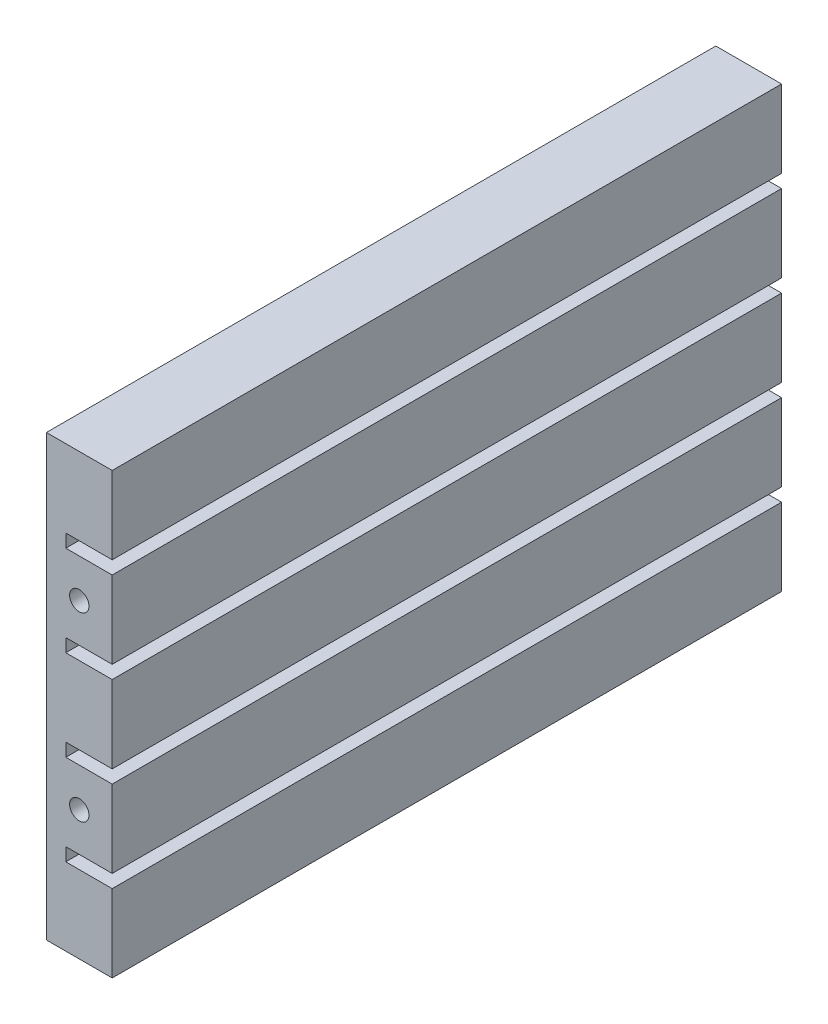
ISO-10303-21;
HEADER;
FILE_DESCRIPTION(('STEP AP214'),'2;1');
FILE_NAME('part.step','',(''),(''),'','','');
FILE_SCHEMA(('AUTOMOTIVE_DESIGN { 1 0 10303 214 1 1 1 1 }'));
ENDSEC;
DATA;
#1=APPLICATION_CONTEXT('core data for automotive mechanical design processes');
#2=APPLICATION_PROTOCOL_DEFINITION('international standard','automotive_design',2000,#1);
#3=PRODUCT_CONTEXT('',#1,'mechanical');
#4=PRODUCT('Part','Part','',(#3));
#5=PRODUCT_RELATED_PRODUCT_CATEGORY('part','',(#4));
#6=PRODUCT_DEFINITION_FORMATION('','',#4);
#7=PRODUCT_DEFINITION_CONTEXT('part definition',#1,'design');
#8=PRODUCT_DEFINITION('design','',#6,#7);
#9=PRODUCT_DEFINITION_SHAPE('','',#8);
#10=(LENGTH_UNIT() NAMED_UNIT(*) SI_UNIT(.MILLI.,.METRE.));
#11=(NAMED_UNIT(*) PLANE_ANGLE_UNIT() SI_UNIT($,.RADIAN.));
#12=(NAMED_UNIT(*) SI_UNIT($,.STERADIAN.) SOLID_ANGLE_UNIT());
#13=UNCERTAINTY_MEASURE_WITH_UNIT(LENGTH_MEASURE(1.E-05),#10,'distance_accuracy_value','');
#14=(GEOMETRIC_REPRESENTATION_CONTEXT(3) GLOBAL_UNCERTAINTY_ASSIGNED_CONTEXT((#13)) GLOBAL_UNIT_ASSIGNED_CONTEXT((#10,
#11,#12)) REPRESENTATION_CONTEXT('',''));
#15=CARTESIAN_POINT('',(0.,0.,0.));
#16=DIRECTION('',(0.,0.,1.));
#17=DIRECTION('',(1.,0.,0.));
#18=AXIS2_PLACEMENT_3D('',#15,#16,#17);
#19=CARTESIAN_POINT('',(8.50000000000001,0.,86.5));
#20=DIRECTION('',(0.,1.,0.));
#21=DIRECTION('',(0.,0.,1.));
#22=AXIS2_PLACEMENT_3D('',#19,#20,#21);
#23=PLANE('',#22);
#24=DIRECTION('',(1.,0.,0.));
#25=VECTOR('',#24,1.);
#26=CARTESIAN_POINT('',(8.50000000000001,0.,0.));
#27=LINE('',#26,#25);
#28=CARTESIAN_POINT('',(0.,0.,0.));
#29=VERTEX_POINT('',#28);
#30=CARTESIAN_POINT('',(8.50000000000001,0.,0.));
#31=VERTEX_POINT('',#30);
#32=EDGE_CURVE('E209',#29,#31,#27,.T.);
#33=ORIENTED_EDGE('',*,*,#32,.T.);
#34=DIRECTION('',(0.,0.,-1.));
#35=VECTOR('',#34,1.);
#36=CARTESIAN_POINT('',(8.50000000000001,0.,86.5));
#37=LINE('',#36,#35);
#38=CARTESIAN_POINT('',(8.50000000000001,0.,86.5));
#39=VERTEX_POINT('',#38);
#40=EDGE_CURVE('E11',#39,#31,#37,.T.);
#41=ORIENTED_EDGE('',*,*,#40,.F.);
#42=DIRECTION('',(1.,0.,0.));
#43=VECTOR('',#42,1.);
#44=CARTESIAN_POINT('',(8.50000000000001,0.,86.5));
#45=LINE('',#44,#43);
#46=CARTESIAN_POINT('',(0.,0.,86.5));
#47=VERTEX_POINT('',#46);
#48=EDGE_CURVE('E248',#47,#39,#45,.T.);
#49=ORIENTED_EDGE('',*,*,#48,.F.);
#50=DIRECTION('',(0.,0.,-1.));
#51=VECTOR('',#50,1.);
#52=CARTESIAN_POINT('',(0.,0.,86.5));
#53=LINE('',#52,#51);
#54=EDGE_CURVE('E205',#47,#29,#53,.T.);
#55=ORIENTED_EDGE('',*,*,#54,.T.);
#56=EDGE_LOOP('',(#33,#41,#49,#55));
#57=FACE_BOUND('',#56,.T.);
#58=ADVANCED_FACE('F38',(#57),#23,.F.);
#59=CARTESIAN_POINT('',(8.50000000000001,9.99999999999999,86.5));
#60=DIRECTION('',(-1.,0.,0.));
#61=DIRECTION('',(0.,0.,1.));
#62=AXIS2_PLACEMENT_3D('',#59,#60,#61);
#63=PLANE('',#62);
#64=DIRECTION('',(0.,1.,0.));
#65=VECTOR('',#64,1.);
#66=CARTESIAN_POINT('',(8.50000000000001,9.99999999999999,0.));
#67=LINE('',#66,#65);
#68=CARTESIAN_POINT('',(8.50000000000001,9.99999999999999,0.));
#69=VERTEX_POINT('',#68);
#70=EDGE_CURVE('E212',#31,#69,#67,.T.);
#71=ORIENTED_EDGE('',*,*,#70,.T.);
#72=DIRECTION('',(0.,0.,-1.));
#73=VECTOR('',#72,1.);
#74=CARTESIAN_POINT('',(8.50000000000001,9.99999999999999,86.5));
#75=LINE('',#74,#73);
#76=CARTESIAN_POINT('',(8.50000000000001,9.99999999999999,86.5));
#77=VERTEX_POINT('',#76);
#78=EDGE_CURVE('E46',#77,#69,#75,.T.);
#79=ORIENTED_EDGE('',*,*,#78,.F.);
#80=DIRECTION('',(0.,1.,0.));
#81=VECTOR('',#80,1.);
#82=CARTESIAN_POINT('',(8.50000000000001,9.99999999999999,86.5));
#83=LINE('',#82,#81);
#84=EDGE_CURVE('E134',#39,#77,#83,.T.);
#85=ORIENTED_EDGE('',*,*,#84,.F.);
#86=ORIENTED_EDGE('',*,*,#40,.T.);
#87=EDGE_LOOP('',(#71,#79,#85,#86));
#88=FACE_BOUND('',#87,.T.);
#89=ADVANCED_FACE('F370',(#88),#63,.F.);
#90=CARTESIAN_POINT('',(2.5,9.99999999999999,86.5));
#91=DIRECTION('',(0.,-1.,0.));
#92=DIRECTION('',(0.,0.,-1.));
#93=AXIS2_PLACEMENT_3D('',#90,#91,#92);
#94=PLANE('',#93);
#95=DIRECTION('',(-1.,0.,0.));
#96=VECTOR('',#95,1.);
#97=CARTESIAN_POINT('',(2.5,9.99999999999999,0.));
#98=LINE('',#97,#96);
#99=CARTESIAN_POINT('',(2.5,9.99999999999999,0.));
#100=VERTEX_POINT('',#99);
#101=EDGE_CURVE('E215',#69,#100,#98,.T.);
#102=ORIENTED_EDGE('',*,*,#101,.T.);
#103=DIRECTION('',(0.,0.,-1.));
#104=VECTOR('',#103,1.);
#105=CARTESIAN_POINT('',(2.5,9.99999999999999,86.5));
#106=LINE('',#105,#104);
#107=CARTESIAN_POINT('',(2.5,9.99999999999999,86.5));
#108=VERTEX_POINT('',#107);
#109=EDGE_CURVE('E291',#108,#100,#106,.T.);
#110=ORIENTED_EDGE('',*,*,#109,.F.);
#111=DIRECTION('',(-1.,0.,0.));
#112=VECTOR('',#111,1.);
#113=CARTESIAN_POINT('',(2.5,9.99999999999999,86.5));
#114=LINE('',#113,#112);
#115=EDGE_CURVE('E299',#77,#108,#114,.T.);
#116=ORIENTED_EDGE('',*,*,#115,.F.);
#117=ORIENTED_EDGE('',*,*,#78,.T.);
#118=EDGE_LOOP('',(#102,#110,#116,#117));
#119=FACE_BOUND('',#118,.T.);
#120=ADVANCED_FACE('F297',(#119),#94,.F.);
#121=CARTESIAN_POINT('',(2.5,11.7,86.5));
#122=DIRECTION('',(-1.,0.,0.));
#123=DIRECTION('',(0.,0.,1.));
#124=AXIS2_PLACEMENT_3D('',#121,#122,#123);
#125=PLANE('',#124);
#126=DIRECTION('',(0.,1.,0.));
#127=VECTOR('',#126,1.);
#128=CARTESIAN_POINT('',(2.5,11.7,0.));
#129=LINE('',#128,#127);
#130=CARTESIAN_POINT('',(2.5,11.7,0.));
#131=VERTEX_POINT('',#130);
#132=EDGE_CURVE('E217',#100,#131,#129,.T.);
#133=ORIENTED_EDGE('',*,*,#132,.T.);
#134=DIRECTION('',(0.,0.,-1.));
#135=VECTOR('',#134,1.);
#136=CARTESIAN_POINT('',(2.5,11.7,86.5));
#137=LINE('',#136,#135);
#138=CARTESIAN_POINT('',(2.5,11.7,86.5));
#139=VERTEX_POINT('',#138);
#140=EDGE_CURVE('E288',#139,#131,#137,.T.);
#141=ORIENTED_EDGE('',*,*,#140,.F.);
#142=DIRECTION('',(0.,1.,0.));
#143=VECTOR('',#142,1.);
#144=CARTESIAN_POINT('',(2.5,11.7,86.5));
#145=LINE('',#144,#143);
#146=EDGE_CURVE('E317',#108,#139,#145,.T.);
#147=ORIENTED_EDGE('',*,*,#146,.F.);
#148=ORIENTED_EDGE('',*,*,#109,.T.);
#149=EDGE_LOOP('',(#133,#141,#147,#148));
#150=FACE_BOUND('',#149,.T.);
#151=ADVANCED_FACE('F308',(#150),#125,.F.);
#152=CARTESIAN_POINT('',(8.50000000000001,11.7,86.5));
#153=DIRECTION('',(0.,1.,0.));
#154=DIRECTION('',(0.,0.,1.));
#155=AXIS2_PLACEMENT_3D('',#152,#153,#154);
#156=PLANE('',#155);
#157=DIRECTION('',(1.,0.,0.));
#158=VECTOR('',#157,1.);
#159=CARTESIAN_POINT('',(8.50000000000001,11.7,0.));
#160=LINE('',#159,#158);
#161=CARTESIAN_POINT('',(8.50000000000001,11.7,0.));
#162=VERTEX_POINT('',#161);
#163=EDGE_CURVE('E219',#131,#162,#160,.T.);
#164=ORIENTED_EDGE('',*,*,#163,.T.);
#165=DIRECTION('',(0.,0.,-1.));
#166=VECTOR('',#165,1.);
#167=CARTESIAN_POINT('',(8.50000000000001,11.7,86.5));
#168=LINE('',#167,#166);
#169=CARTESIAN_POINT('',(8.50000000000001,11.7,86.5));
#170=VERTEX_POINT('',#169);
#171=EDGE_CURVE('E285',#170,#162,#168,.T.);
#172=ORIENTED_EDGE('',*,*,#171,.F.);
#173=DIRECTION('',(1.,0.,0.));
#174=VECTOR('',#173,1.);
#175=CARTESIAN_POINT('',(8.50000000000001,11.7,86.5));
#176=LINE('',#175,#174);
#177=EDGE_CURVE('E314',#139,#170,#176,.T.);
#178=ORIENTED_EDGE('',*,*,#177,.F.);
#179=ORIENTED_EDGE('',*,*,#140,.T.);
#180=EDGE_LOOP('',(#164,#172,#178,#179));
#181=FACE_BOUND('',#180,.T.);
#182=ADVANCED_FACE('F312',(#181),#156,.F.);
#183=CARTESIAN_POINT('',(8.50000000000001,21.7,86.5));
#184=DIRECTION('',(-1.,0.,0.));
#185=DIRECTION('',(0.,-1.,0.));
#186=AXIS2_PLACEMENT_3D('',#183,#184,#185);
#187=PLANE('',#186);
#188=DIRECTION('',(0.,1.,0.));
#189=VECTOR('',#188,1.);
#190=CARTESIAN_POINT('',(8.50000000000001,21.7,0.));
#191=LINE('',#190,#189);
#192=CARTESIAN_POINT('',(8.50000000000001,21.7,0.));
#193=VERTEX_POINT('',#192);
#194=EDGE_CURVE('E221',#162,#193,#191,.T.);
#195=ORIENTED_EDGE('',*,*,#194,.T.);
#196=DIRECTION('',(0.,0.,-1.));
#197=VECTOR('',#196,1.);
#198=CARTESIAN_POINT('',(8.50000000000001,21.7,86.5));
#199=LINE('',#198,#197);
#200=CARTESIAN_POINT('',(8.50000000000001,21.7,86.5));
#201=VERTEX_POINT('',#200);
#202=EDGE_CURVE('E282',#201,#193,#199,.T.);
#203=ORIENTED_EDGE('',*,*,#202,.F.);
#204=DIRECTION('',(0.,1.,0.));
#205=VECTOR('',#204,1.);
#206=CARTESIAN_POINT('',(8.50000000000001,21.7,86.5));
#207=LINE('',#206,#205);
#208=EDGE_CURVE('E316',#170,#201,#207,.T.);
#209=ORIENTED_EDGE('',*,*,#208,.F.);
#210=ORIENTED_EDGE('',*,*,#171,.T.);
#211=EDGE_LOOP('',(#195,#203,#209,#210));
#212=FACE_BOUND('',#211,.T.);
#213=ADVANCED_FACE('F383',(#212),#187,.F.);
#214=CARTESIAN_POINT('',(2.5,21.7,86.5));
#215=DIRECTION('',(0.,-1.,0.));
#216=DIRECTION('',(0.,0.,-1.));
#217=AXIS2_PLACEMENT_3D('',#214,#215,#216);
#218=PLANE('',#217);
#219=DIRECTION('',(-1.,0.,0.));
#220=VECTOR('',#219,1.);
#221=CARTESIAN_POINT('',(2.5,21.7,0.));
#222=LINE('',#221,#220);
#223=CARTESIAN_POINT('',(2.5,21.7,0.));
#224=VERTEX_POINT('',#223);
#225=EDGE_CURVE('E223',#193,#224,#222,.T.);
#226=ORIENTED_EDGE('',*,*,#225,.T.);
#227=DIRECTION('',(0.,0.,-1.));
#228=VECTOR('',#227,1.);
#229=CARTESIAN_POINT('',(2.5,21.7,86.5));
#230=LINE('',#229,#228);
#231=CARTESIAN_POINT('',(2.5,21.7,86.5));
#232=VERTEX_POINT('',#231);
#233=EDGE_CURVE('E279',#232,#224,#230,.T.);
#234=ORIENTED_EDGE('',*,*,#233,.F.);
#235=DIRECTION('',(-1.,0.,0.));
#236=VECTOR('',#235,1.);
#237=CARTESIAN_POINT('',(2.5,21.7,86.5));
#238=LINE('',#237,#236);
#239=EDGE_CURVE('E319',#201,#232,#238,.T.);
#240=ORIENTED_EDGE('',*,*,#239,.F.);
#241=ORIENTED_EDGE('',*,*,#202,.T.);
#242=EDGE_LOOP('',(#226,#234,#240,#241));
#243=FACE_BOUND('',#242,.T.);
#244=ADVANCED_FACE('F386',(#243),#218,.F.);
#245=CARTESIAN_POINT('',(2.5,23.4,86.5));
#246=DIRECTION('',(-1.,0.,0.));
#247=DIRECTION('',(0.,0.,1.));
#248=AXIS2_PLACEMENT_3D('',#245,#246,#247);
#249=PLANE('',#248);
#250=DIRECTION('',(0.,1.,0.));
#251=VECTOR('',#250,1.);
#252=CARTESIAN_POINT('',(2.5,23.4,0.));
#253=LINE('',#252,#251);
#254=CARTESIAN_POINT('',(2.5,23.4,0.));
#255=VERTEX_POINT('',#254);
#256=EDGE_CURVE('E225',#224,#255,#253,.T.);
#257=ORIENTED_EDGE('',*,*,#256,.T.);
#258=DIRECTION('',(0.,0.,-1.));
#259=VECTOR('',#258,1.);
#260=CARTESIAN_POINT('',(2.5,23.4,86.5));
#261=LINE('',#260,#259);
#262=CARTESIAN_POINT('',(2.5,23.4,86.5));
#263=VERTEX_POINT('',#262);
#264=EDGE_CURVE('E276',#263,#255,#261,.T.);
#265=ORIENTED_EDGE('',*,*,#264,.F.);
#266=DIRECTION('',(0.,1.,0.));
#267=VECTOR('',#266,1.);
#268=CARTESIAN_POINT('',(2.5,23.4,86.5));
#269=LINE('',#268,#267);
#270=EDGE_CURVE('E325',#232,#263,#269,.T.);
#271=ORIENTED_EDGE('',*,*,#270,.F.);
#272=ORIENTED_EDGE('',*,*,#233,.T.);
#273=EDGE_LOOP('',(#257,#265,#271,#272));
#274=FACE_BOUND('',#273,.T.);
#275=ADVANCED_FACE('F390',(#274),#249,.F.);
#276=CARTESIAN_POINT('',(8.50000000000001,23.4,86.5));
#277=DIRECTION('',(0.,1.,0.));
#278=DIRECTION('',(0.,0.,1.));
#279=AXIS2_PLACEMENT_3D('',#276,#277,#278);
#280=PLANE('',#279);
#281=DIRECTION('',(1.,0.,0.));
#282=VECTOR('',#281,1.);
#283=CARTESIAN_POINT('',(8.50000000000001,23.4,0.));
#284=LINE('',#283,#282);
#285=CARTESIAN_POINT('',(8.50000000000001,23.4,0.));
#286=VERTEX_POINT('',#285);
#287=EDGE_CURVE('E227',#255,#286,#284,.T.);
#288=ORIENTED_EDGE('',*,*,#287,.T.);
#289=DIRECTION('',(0.,0.,-1.));
#290=VECTOR('',#289,1.);
#291=CARTESIAN_POINT('',(8.50000000000001,23.4,86.5));
#292=LINE('',#291,#290);
#293=CARTESIAN_POINT('',(8.50000000000001,23.4,86.5));
#294=VERTEX_POINT('',#293);
#295=EDGE_CURVE('E273',#294,#286,#292,.T.);
#296=ORIENTED_EDGE('',*,*,#295,.F.);
#297=DIRECTION('',(1.,0.,0.));
#298=VECTOR('',#297,1.);
#299=CARTESIAN_POINT('',(8.50000000000001,23.4,86.5));
#300=LINE('',#299,#298);
#301=EDGE_CURVE('E327',#263,#294,#300,.T.);
#302=ORIENTED_EDGE('',*,*,#301,.F.);
#303=ORIENTED_EDGE('',*,*,#264,.T.);
#304=EDGE_LOOP('',(#288,#296,#302,#303));
#305=FACE_BOUND('',#304,.T.);
#306=ADVANCED_FACE('F394',(#305),#280,.F.);
#307=CARTESIAN_POINT('',(8.5,33.4,86.5));
#308=DIRECTION('',(-1.,0.,0.));
#309=DIRECTION('',(0.,-1.,0.));
#310=AXIS2_PLACEMENT_3D('',#307,#308,#309);
#311=PLANE('',#310);
#312=DIRECTION('',(0.,1.,0.));
#313=VECTOR('',#312,1.);
#314=CARTESIAN_POINT('',(8.5,33.4,0.));
#315=LINE('',#314,#313);
#316=CARTESIAN_POINT('',(8.5,33.4,0.));
#317=VERTEX_POINT('',#316);
#318=EDGE_CURVE('E229',#286,#317,#315,.T.);
#319=ORIENTED_EDGE('',*,*,#318,.T.);
#320=DIRECTION('',(0.,0.,-1.));
#321=VECTOR('',#320,1.);
#322=CARTESIAN_POINT('',(8.5,33.4,86.5));
#323=LINE('',#322,#321);
#324=CARTESIAN_POINT('',(8.5,33.4,86.5));
#325=VERTEX_POINT('',#324);
#326=EDGE_CURVE('E270',#325,#317,#323,.T.);
#327=ORIENTED_EDGE('',*,*,#326,.F.);
#328=DIRECTION('',(0.,1.,0.));
#329=VECTOR('',#328,1.);
#330=CARTESIAN_POINT('',(8.5,33.4,86.5));
#331=LINE('',#330,#329);
#332=EDGE_CURVE('E329',#294,#325,#331,.T.);
#333=ORIENTED_EDGE('',*,*,#332,.F.);
#334=ORIENTED_EDGE('',*,*,#295,.T.);
#335=EDGE_LOOP('',(#319,#327,#333,#334));
#336=FACE_BOUND('',#335,.T.);
#337=ADVANCED_FACE('F398',(#336),#311,.F.);
#338=CARTESIAN_POINT('',(2.5,33.4,86.5));
#339=DIRECTION('',(0.,-1.,0.));
#340=DIRECTION('',(0.,0.,-1.));
#341=AXIS2_PLACEMENT_3D('',#338,#339,#340);
#342=PLANE('',#341);
#343=DIRECTION('',(-1.,0.,0.));
#344=VECTOR('',#343,1.);
#345=CARTESIAN_POINT('',(2.5,33.4,0.));
#346=LINE('',#345,#344);
#347=CARTESIAN_POINT('',(2.5,33.4,0.));
#348=VERTEX_POINT('',#347);
#349=EDGE_CURVE('E231',#317,#348,#346,.T.);
#350=ORIENTED_EDGE('',*,*,#349,.T.);
#351=DIRECTION('',(0.,0.,-1.));
#352=VECTOR('',#351,1.);
#353=CARTESIAN_POINT('',(2.5,33.4,86.5));
#354=LINE('',#353,#352);
#355=CARTESIAN_POINT('',(2.5,33.4,86.5));
#356=VERTEX_POINT('',#355);
#357=EDGE_CURVE('E267',#356,#348,#354,.T.);
#358=ORIENTED_EDGE('',*,*,#357,.F.);
#359=DIRECTION('',(-1.,0.,0.));
#360=VECTOR('',#359,1.);
#361=CARTESIAN_POINT('',(2.5,33.4,86.5));
#362=LINE('',#361,#360);
#363=EDGE_CURVE('E331',#325,#356,#362,.T.);
#364=ORIENTED_EDGE('',*,*,#363,.F.);
#365=ORIENTED_EDGE('',*,*,#326,.T.);
#366=EDGE_LOOP('',(#350,#358,#364,#365));
#367=FACE_BOUND('',#366,.T.);
#368=ADVANCED_FACE('F402',(#367),#342,.F.);
#369=CARTESIAN_POINT('',(2.5,35.1,86.5));
#370=DIRECTION('',(-1.,0.,0.));
#371=DIRECTION('',(0.,0.,1.));
#372=AXIS2_PLACEMENT_3D('',#369,#370,#371);
#373=PLANE('',#372);
#374=DIRECTION('',(0.,1.,0.));
#375=VECTOR('',#374,1.);
#376=CARTESIAN_POINT('',(2.5,35.1,0.));
#377=LINE('',#376,#375);
#378=CARTESIAN_POINT('',(2.5,35.1,0.));
#379=VERTEX_POINT('',#378);
#380=EDGE_CURVE('E233',#348,#379,#377,.T.);
#381=ORIENTED_EDGE('',*,*,#380,.T.);
#382=DIRECTION('',(0.,0.,-1.));
#383=VECTOR('',#382,1.);
#384=CARTESIAN_POINT('',(2.5,35.1,86.5));
#385=LINE('',#384,#383);
#386=CARTESIAN_POINT('',(2.5,35.1,86.5));
#387=VERTEX_POINT('',#386);
#388=EDGE_CURVE('E264',#387,#379,#385,.T.);
#389=ORIENTED_EDGE('',*,*,#388,.F.);
#390=DIRECTION('',(0.,1.,0.));
#391=VECTOR('',#390,1.);
#392=CARTESIAN_POINT('',(2.5,35.1,86.5));
#393=LINE('',#392,#391);
#394=EDGE_CURVE('E333',#356,#387,#393,.T.);
#395=ORIENTED_EDGE('',*,*,#394,.F.);
#396=ORIENTED_EDGE('',*,*,#357,.T.);
#397=EDGE_LOOP('',(#381,#389,#395,#396));
#398=FACE_BOUND('',#397,.T.);
#399=ADVANCED_FACE('F406',(#398),#373,.F.);
#400=CARTESIAN_POINT('',(8.5,35.1,86.5));
#401=DIRECTION('',(0.,1.,0.));
#402=DIRECTION('',(0.,0.,1.));
#403=AXIS2_PLACEMENT_3D('',#400,#401,#402);
#404=PLANE('',#403);
#405=DIRECTION('',(1.,0.,0.));
#406=VECTOR('',#405,1.);
#407=CARTESIAN_POINT('',(8.5,35.1,0.));
#408=LINE('',#407,#406);
#409=CARTESIAN_POINT('',(8.5,35.1,0.));
#410=VERTEX_POINT('',#409);
#411=EDGE_CURVE('E235',#379,#410,#408,.T.);
#412=ORIENTED_EDGE('',*,*,#411,.T.);
#413=DIRECTION('',(0.,0.,-1.));
#414=VECTOR('',#413,1.);
#415=CARTESIAN_POINT('',(8.5,35.1,86.5));
#416=LINE('',#415,#414);
#417=CARTESIAN_POINT('',(8.5,35.1,86.5));
#418=VERTEX_POINT('',#417);
#419=EDGE_CURVE('E261',#418,#410,#416,.T.);
#420=ORIENTED_EDGE('',*,*,#419,.F.);
#421=DIRECTION('',(1.,0.,0.));
#422=VECTOR('',#421,1.);
#423=CARTESIAN_POINT('',(8.5,35.1,86.5));
#424=LINE('',#423,#422);
#425=EDGE_CURVE('E335',#387,#418,#424,.T.);
#426=ORIENTED_EDGE('',*,*,#425,.F.);
#427=ORIENTED_EDGE('',*,*,#388,.T.);
#428=EDGE_LOOP('',(#412,#420,#426,#427));
#429=FACE_BOUND('',#428,.T.);
#430=ADVANCED_FACE('F410',(#429),#404,.F.);
#431=CARTESIAN_POINT('',(8.5,45.1,86.5));
#432=DIRECTION('',(-1.,0.,0.));
#433=DIRECTION('',(0.,-1.,0.));
#434=AXIS2_PLACEMENT_3D('',#431,#432,#433);
#435=PLANE('',#434);
#436=DIRECTION('',(0.,1.,0.));
#437=VECTOR('',#436,1.);
#438=CARTESIAN_POINT('',(8.5,45.1,0.));
#439=LINE('',#438,#437);
#440=CARTESIAN_POINT('',(8.5,45.1,0.));
#441=VERTEX_POINT('',#440);
#442=EDGE_CURVE('E237',#410,#441,#439,.T.);
#443=ORIENTED_EDGE('',*,*,#442,.T.);
#444=DIRECTION('',(0.,0.,-1.));
#445=VECTOR('',#444,1.);
#446=CARTESIAN_POINT('',(8.5,45.1,86.5));
#447=LINE('',#446,#445);
#448=CARTESIAN_POINT('',(8.5,45.1,86.5));
#449=VERTEX_POINT('',#448);
#450=EDGE_CURVE('E258',#449,#441,#447,.T.);
#451=ORIENTED_EDGE('',*,*,#450,.F.);
#452=DIRECTION('',(0.,1.,0.));
#453=VECTOR('',#452,1.);
#454=CARTESIAN_POINT('',(8.5,45.1,86.5));
#455=LINE('',#454,#453);
#456=EDGE_CURVE('E337',#418,#449,#455,.T.);
#457=ORIENTED_EDGE('',*,*,#456,.F.);
#458=ORIENTED_EDGE('',*,*,#419,.T.);
#459=EDGE_LOOP('',(#443,#451,#457,#458));
#460=FACE_BOUND('',#459,.T.);
#461=ADVANCED_FACE('F414',(#460),#435,.F.);
#462=CARTESIAN_POINT('',(2.5,45.1,86.5));
#463=DIRECTION('',(0.,-1.,0.));
#464=DIRECTION('',(0.,0.,-1.));
#465=AXIS2_PLACEMENT_3D('',#462,#463,#464);
#466=PLANE('',#465);
#467=DIRECTION('',(-1.,0.,0.));
#468=VECTOR('',#467,1.);
#469=CARTESIAN_POINT('',(2.5,45.1,0.));
#470=LINE('',#469,#468);
#471=CARTESIAN_POINT('',(2.5,45.1,0.));
#472=VERTEX_POINT('',#471);
#473=EDGE_CURVE('E239',#441,#472,#470,.T.);
#474=ORIENTED_EDGE('',*,*,#473,.T.);
#475=DIRECTION('',(0.,0.,-1.));
#476=VECTOR('',#475,1.);
#477=CARTESIAN_POINT('',(2.5,45.1,86.5));
#478=LINE('',#477,#476);
#479=CARTESIAN_POINT('',(2.5,45.1,86.5));
#480=VERTEX_POINT('',#479);
#481=EDGE_CURVE('E255',#480,#472,#478,.T.);
#482=ORIENTED_EDGE('',*,*,#481,.F.);
#483=DIRECTION('',(-1.,0.,0.));
#484=VECTOR('',#483,1.);
#485=CARTESIAN_POINT('',(2.5,45.1,86.5));
#486=LINE('',#485,#484);
#487=EDGE_CURVE('E339',#449,#480,#486,.T.);
#488=ORIENTED_EDGE('',*,*,#487,.F.);
#489=ORIENTED_EDGE('',*,*,#450,.T.);
#490=EDGE_LOOP('',(#474,#482,#488,#489));
#491=FACE_BOUND('',#490,.T.);
#492=ADVANCED_FACE('F418',(#491),#466,.F.);
#493=CARTESIAN_POINT('',(2.5,46.8,86.5));
#494=DIRECTION('',(-1.,0.,0.));
#495=DIRECTION('',(0.,0.,1.));
#496=AXIS2_PLACEMENT_3D('',#493,#494,#495);
#497=PLANE('',#496);
#498=DIRECTION('',(0.,1.,0.));
#499=VECTOR('',#498,1.);
#500=CARTESIAN_POINT('',(2.5,46.8,0.));
#501=LINE('',#500,#499);
#502=CARTESIAN_POINT('',(2.5,46.8,0.));
#503=VERTEX_POINT('',#502);
#504=EDGE_CURVE('E241',#472,#503,#501,.T.);
#505=ORIENTED_EDGE('',*,*,#504,.T.);
#506=DIRECTION('',(0.,0.,-1.));
#507=VECTOR('',#506,1.);
#508=CARTESIAN_POINT('',(2.5,46.8,86.5));
#509=LINE('',#508,#507);
#510=CARTESIAN_POINT('',(2.5,46.8,86.5));
#511=VERTEX_POINT('',#510);
#512=EDGE_CURVE('E252',#511,#503,#509,.T.);
#513=ORIENTED_EDGE('',*,*,#512,.F.);
#514=DIRECTION('',(0.,1.,0.));
#515=VECTOR('',#514,1.);
#516=CARTESIAN_POINT('',(2.5,46.8,86.5));
#517=LINE('',#516,#515);
#518=EDGE_CURVE('E341',#480,#511,#517,.T.);
#519=ORIENTED_EDGE('',*,*,#518,.F.);
#520=ORIENTED_EDGE('',*,*,#481,.T.);
#521=EDGE_LOOP('',(#505,#513,#519,#520));
#522=FACE_BOUND('',#521,.T.);
#523=ADVANCED_FACE('F347',(#522),#497,.F.);
#524=CARTESIAN_POINT('',(8.5,46.8,86.5));
#525=DIRECTION('',(0.,1.,0.));
#526=DIRECTION('',(0.,0.,1.));
#527=AXIS2_PLACEMENT_3D('',#524,#525,#526);
#528=PLANE('',#527);
#529=DIRECTION('',(1.,0.,0.));
#530=VECTOR('',#529,1.);
#531=CARTESIAN_POINT('',(8.5,46.8,0.));
#532=LINE('',#531,#530);
#533=CARTESIAN_POINT('',(8.5,46.8,0.));
#534=VERTEX_POINT('',#533);
#535=EDGE_CURVE('E243',#503,#534,#532,.T.);
#536=ORIENTED_EDGE('',*,*,#535,.T.);
#537=DIRECTION('',(0.,0.,-1.));
#538=VECTOR('',#537,1.);
#539=CARTESIAN_POINT('',(8.5,46.8,86.5));
#540=LINE('',#539,#538);
#541=CARTESIAN_POINT('',(8.5,46.8,86.5));
#542=VERTEX_POINT('',#541);
#543=EDGE_CURVE('E200',#542,#534,#540,.T.);
#544=ORIENTED_EDGE('',*,*,#543,.F.);
#545=DIRECTION('',(1.,0.,0.));
#546=VECTOR('',#545,1.);
#547=CARTESIAN_POINT('',(8.5,46.8,86.5));
#548=LINE('',#547,#546);
#549=EDGE_CURVE('E191',#511,#542,#548,.T.);
#550=ORIENTED_EDGE('',*,*,#549,.F.);
#551=ORIENTED_EDGE('',*,*,#512,.T.);
#552=EDGE_LOOP('',(#536,#544,#550,#551));
#553=FACE_BOUND('',#552,.T.);
#554=ADVANCED_FACE('F351',(#553),#528,.F.);
#555=CARTESIAN_POINT('',(8.5,56.8,86.5));
#556=DIRECTION('',(-1.,0.,0.));
#557=DIRECTION('',(0.,-1.,0.));
#558=AXIS2_PLACEMENT_3D('',#555,#556,#557);
#559=PLANE('',#558);
#560=DIRECTION('',(0.,1.,0.));
#561=VECTOR('',#560,1.);
#562=CARTESIAN_POINT('',(8.5,56.8,0.));
#563=LINE('',#562,#561);
#564=CARTESIAN_POINT('',(8.5,56.8,0.));
#565=VERTEX_POINT('',#564);
#566=EDGE_CURVE('E199',#534,#565,#563,.T.);
#567=ORIENTED_EDGE('',*,*,#566,.T.);
#568=DIRECTION('',(0.,0.,-1.));
#569=VECTOR('',#568,1.);
#570=CARTESIAN_POINT('',(8.5,56.8,86.5));
#571=LINE('',#570,#569);
#572=CARTESIAN_POINT('',(8.5,56.8,86.5));
#573=VERTEX_POINT('',#572);
#574=EDGE_CURVE('E196',#573,#565,#571,.T.);
#575=ORIENTED_EDGE('',*,*,#574,.F.);
#576=DIRECTION('',(0.,1.,0.));
#577=VECTOR('',#576,1.);
#578=CARTESIAN_POINT('',(8.5,56.8,86.5));
#579=LINE('',#578,#577);
#580=EDGE_CURVE('E185',#542,#573,#579,.T.);
#581=ORIENTED_EDGE('',*,*,#580,.F.);
#582=ORIENTED_EDGE('',*,*,#543,.T.);
#583=EDGE_LOOP('',(#567,#575,#581,#582));
#584=FACE_BOUND('',#583,.T.);
#585=ADVANCED_FACE('F197',(#584),#559,.F.);
#586=CARTESIAN_POINT('',(0.,56.8,86.5));
#587=DIRECTION('',(0.,-1.,0.));
#588=DIRECTION('',(0.,0.,-1.));
#589=AXIS2_PLACEMENT_3D('',#586,#587,#588);
#590=PLANE('',#589);
#591=DIRECTION('',(-1.,0.,0.));
#592=VECTOR('',#591,1.);
#593=CARTESIAN_POINT('',(0.,56.8,0.));
#594=LINE('',#593,#592);
#595=CARTESIAN_POINT('',(0.,56.8,0.));
#596=VERTEX_POINT('',#595);
#597=EDGE_CURVE('E120',#565,#596,#594,.T.);
#598=ORIENTED_EDGE('',*,*,#597,.T.);
#599=DIRECTION('',(0.,0.,-1.));
#600=VECTOR('',#599,1.);
#601=CARTESIAN_POINT('',(0.,56.8,86.5));
#602=LINE('',#601,#600);
#603=CARTESIAN_POINT('',(0.,56.8,86.5));
#604=VERTEX_POINT('',#603);
#605=EDGE_CURVE('E201',#604,#596,#602,.T.);
#606=ORIENTED_EDGE('',*,*,#605,.F.);
#607=DIRECTION('',(-1.,0.,0.));
#608=VECTOR('',#607,1.);
#609=CARTESIAN_POINT('',(0.,56.8,86.5));
#610=LINE('',#609,#608);
#611=EDGE_CURVE('E189',#573,#604,#610,.T.);
#612=ORIENTED_EDGE('',*,*,#611,.F.);
#613=ORIENTED_EDGE('',*,*,#574,.T.);
#614=EDGE_LOOP('',(#598,#606,#612,#613));
#615=FACE_BOUND('',#614,.T.);
#616=ADVANCED_FACE('F203',(#615),#590,.F.);
#617=CARTESIAN_POINT('',(0.,0.,86.5));
#618=DIRECTION('',(1.,0.,0.));
#619=DIRECTION('',(0.,0.,-1.));
#620=AXIS2_PLACEMENT_3D('',#617,#618,#619);
#621=PLANE('',#620);
#622=CARTESIAN_POINT('',(0.,51.8,78.25));
#623=DIRECTION('',(-1.,0.,0.));
#624=DIRECTION('',(0.,0.,1.));
#625=AXIS2_PLACEMENT_3D('',#622,#623,#624);
#626=CIRCLE('',#625,1.25);
#627=CARTESIAN_POINT('',(0.,51.8,79.5));
#628=VERTEX_POINT('',#627);
#629=EDGE_CURVE('E623',#628,#628,#626,.T.);
#630=ORIENTED_EDGE('',*,*,#629,.F.);
#631=EDGE_LOOP('',(#630));
#632=FACE_BOUND('',#631,.T.);
#633=CARTESIAN_POINT('',(0.,5.,78.25));
#634=DIRECTION('',(-1.,0.,0.));
#635=DIRECTION('',(0.,0.,1.));
#636=AXIS2_PLACEMENT_3D('',#633,#634,#635);
#637=CIRCLE('',#636,1.25);
#638=CARTESIAN_POINT('',(0.,5.,79.5));
#639=VERTEX_POINT('',#638);
#640=EDGE_CURVE('E625',#639,#639,#637,.T.);
#641=ORIENTED_EDGE('',*,*,#640,.F.);
#642=EDGE_LOOP('',(#641));
#643=FACE_BOUND('',#642,.T.);
#644=CARTESIAN_POINT('',(0.,51.8,8.24999999999999));
#645=DIRECTION('',(-1.,0.,0.));
#646=DIRECTION('',(0.,0.,1.));
#647=AXIS2_PLACEMENT_3D('',#644,#645,#646);
#648=CIRCLE('',#647,1.25);
#649=CARTESIAN_POINT('',(0.,51.8,9.49999999999999));
#650=VERTEX_POINT('',#649);
#651=EDGE_CURVE('E633',#650,#650,#648,.T.);
#652=ORIENTED_EDGE('',*,*,#651,.F.);
#653=EDGE_LOOP('',(#652));
#654=FACE_BOUND('',#653,.T.);
#655=CARTESIAN_POINT('',(0.,5.,8.24999999999999));
#656=DIRECTION('',(-1.,0.,0.));
#657=DIRECTION('',(0.,0.,1.));
#658=AXIS2_PLACEMENT_3D('',#655,#656,#657);
#659=CIRCLE('',#658,1.25);
#660=CARTESIAN_POINT('',(0.,5.,9.49999999999999));
#661=VERTEX_POINT('',#660);
#662=EDGE_CURVE('E639',#661,#661,#659,.T.);
#663=ORIENTED_EDGE('',*,*,#662,.F.);
#664=EDGE_LOOP('',(#663));
#665=FACE_BOUND('',#664,.T.);
#666=DIRECTION('',(0.,-1.,0.));
#667=VECTOR('',#666,1.);
#668=CARTESIAN_POINT('',(0.,0.,0.));
#669=LINE('',#668,#667);
#670=EDGE_CURVE('E126',#596,#29,#669,.T.);
#671=ORIENTED_EDGE('',*,*,#670,.T.);
#672=ORIENTED_EDGE('',*,*,#54,.F.);
#673=DIRECTION('',(0.,-1.,0.));
#674=VECTOR('',#673,1.);
#675=CARTESIAN_POINT('',(0.,0.,86.5));
#676=LINE('',#675,#674);
#677=EDGE_CURVE('E54',#604,#47,#676,.T.);
#678=ORIENTED_EDGE('',*,*,#677,.F.);
#679=ORIENTED_EDGE('',*,*,#605,.T.);
#680=EDGE_LOOP('',(#671,#672,#678,#679));
#681=FACE_BOUND('',#680,.T.);
#682=ADVANCED_FACE('F355',(#632,#643,#654,#665,#681),#621,.F.);
#683=CARTESIAN_POINT('',(0.,0.,86.5));
#684=DIRECTION('',(0.,0.,-1.));
#685=DIRECTION('',(-1.,0.,0.));
#686=AXIS2_PLACEMENT_3D('',#683,#684,#685);
#687=PLANE('',#686);
#688=CARTESIAN_POINT('',(4.25,40.1,86.5));
#689=DIRECTION('',(0.,0.,1.));
#690=DIRECTION('',(1.,0.,0.));
#691=AXIS2_PLACEMENT_3D('',#688,#689,#690);
#692=CIRCLE('',#691,1.25);
#693=CARTESIAN_POINT('',(5.5,40.1,86.5));
#694=VERTEX_POINT('',#693);
#695=EDGE_CURVE('E657',#694,#694,#692,.T.);
#696=ORIENTED_EDGE('',*,*,#695,.F.);
#697=EDGE_LOOP('',(#696));
#698=FACE_BOUND('',#697,.T.);
#699=CARTESIAN_POINT('',(4.25,16.7,86.5));
#700=DIRECTION('',(0.,0.,1.));
#701=DIRECTION('',(1.,0.,0.));
#702=AXIS2_PLACEMENT_3D('',#699,#700,#701);
#703=CIRCLE('',#702,1.25);
#704=CARTESIAN_POINT('',(5.5,16.7,86.5));
#705=VERTEX_POINT('',#704);
#706=EDGE_CURVE('E663',#705,#705,#703,.T.);
#707=ORIENTED_EDGE('',*,*,#706,.F.);
#708=EDGE_LOOP('',(#707));
#709=FACE_BOUND('',#708,.T.);
#710=ORIENTED_EDGE('',*,*,#48,.T.);
#711=ORIENTED_EDGE('',*,*,#84,.T.);
#712=ORIENTED_EDGE('',*,*,#115,.T.);
#713=ORIENTED_EDGE('',*,*,#146,.T.);
#714=ORIENTED_EDGE('',*,*,#177,.T.);
#715=ORIENTED_EDGE('',*,*,#208,.T.);
#716=ORIENTED_EDGE('',*,*,#239,.T.);
#717=ORIENTED_EDGE('',*,*,#270,.T.);
#718=ORIENTED_EDGE('',*,*,#301,.T.);
#719=ORIENTED_EDGE('',*,*,#332,.T.);
#720=ORIENTED_EDGE('',*,*,#363,.T.);
#721=ORIENTED_EDGE('',*,*,#394,.T.);
#722=ORIENTED_EDGE('',*,*,#425,.T.);
#723=ORIENTED_EDGE('',*,*,#456,.T.);
#724=ORIENTED_EDGE('',*,*,#487,.T.);
#725=ORIENTED_EDGE('',*,*,#518,.T.);
#726=ORIENTED_EDGE('',*,*,#549,.T.);
#727=ORIENTED_EDGE('',*,*,#580,.T.);
#728=ORIENTED_EDGE('',*,*,#611,.T.);
#729=ORIENTED_EDGE('',*,*,#677,.T.);
#730=EDGE_LOOP('',(#710,#711,#712,#713,#714,#715,#716,#717,#718,#719,#720,#721,#722,#723,#724,
#725,#726,#727,#728,#729));
#731=FACE_BOUND('',#730,.T.);
#732=ADVANCED_FACE('F187',(#698,#709,#731),#687,.F.);
#733=CARTESIAN_POINT('',(0.,0.,0.));
#734=DIRECTION('',(0.,0.,-1.));
#735=DIRECTION('',(-1.,0.,0.));
#736=AXIS2_PLACEMENT_3D('',#733,#734,#735);
#737=PLANE('',#736);
#738=CARTESIAN_POINT('',(4.25,40.1,0.));
#739=DIRECTION('',(0.,0.,-1.));
#740=DIRECTION('',(-1.,0.,0.));
#741=AXIS2_PLACEMENT_3D('',#738,#739,#740);
#742=CIRCLE('',#741,1.25);
#743=CARTESIAN_POINT('',(3.,40.1,0.));
#744=VERTEX_POINT('',#743);
#745=EDGE_CURVE('E645',#744,#744,#742,.T.);
#746=ORIENTED_EDGE('',*,*,#745,.F.);
#747=EDGE_LOOP('',(#746));
#748=FACE_BOUND('',#747,.T.);
#749=CARTESIAN_POINT('',(4.25,16.7,0.));
#750=DIRECTION('',(0.,0.,-1.));
#751=DIRECTION('',(-1.,0.,0.));
#752=AXIS2_PLACEMENT_3D('',#749,#750,#751);
#753=CIRCLE('',#752,1.25);
#754=CARTESIAN_POINT('',(3.,16.7,0.));
#755=VERTEX_POINT('',#754);
#756=EDGE_CURVE('E651',#755,#755,#753,.T.);
#757=ORIENTED_EDGE('',*,*,#756,.F.);
#758=EDGE_LOOP('',(#757));
#759=FACE_BOUND('',#758,.T.);
#760=ORIENTED_EDGE('',*,*,#32,.F.);
#761=ORIENTED_EDGE('',*,*,#670,.F.);
#762=ORIENTED_EDGE('',*,*,#597,.F.);
#763=ORIENTED_EDGE('',*,*,#566,.F.);
#764=ORIENTED_EDGE('',*,*,#535,.F.);
#765=ORIENTED_EDGE('',*,*,#504,.F.);
#766=ORIENTED_EDGE('',*,*,#473,.F.);
#767=ORIENTED_EDGE('',*,*,#442,.F.);
#768=ORIENTED_EDGE('',*,*,#411,.F.);
#769=ORIENTED_EDGE('',*,*,#380,.F.);
#770=ORIENTED_EDGE('',*,*,#349,.F.);
#771=ORIENTED_EDGE('',*,*,#318,.F.);
#772=ORIENTED_EDGE('',*,*,#287,.F.);
#773=ORIENTED_EDGE('',*,*,#256,.F.);
#774=ORIENTED_EDGE('',*,*,#225,.F.);
#775=ORIENTED_EDGE('',*,*,#194,.F.);
#776=ORIENTED_EDGE('',*,*,#163,.F.);
#777=ORIENTED_EDGE('',*,*,#132,.F.);
#778=ORIENTED_EDGE('',*,*,#101,.F.);
#779=ORIENTED_EDGE('',*,*,#70,.F.);
#780=EDGE_LOOP('',(#760,#761,#762,#763,#764,#765,#766,#767,#768,#769,#770,#771,#772,#773,#774,
#775,#776,#777,#778,#779));
#781=FACE_BOUND('',#780,.T.);
#782=ADVANCED_FACE('F303',(#748,#759,#781),#737,.T.);
#783=CARTESIAN_POINT('',(4.25,16.7,81.5));
#784=DIRECTION('',(0.,0.,1.));
#785=DIRECTION('',(1.,0.,0.));
#786=AXIS2_PLACEMENT_3D('',#783,#784,#785);
#787=CONICAL_SURFACE('',#786,1.25,1.02974425867666);
#788=CARTESIAN_POINT('',(4.25,16.7,80.7489242262155));
#789=VERTEX_POINT('',#788);
#790=VERTEX_LOOP('',#789);
#791=FACE_BOUND('',#790,.T.);
#792=CARTESIAN_POINT('',(4.25,16.7,81.5));
#793=DIRECTION('',(0.,0.,1.));
#794=DIRECTION('',(1.,0.,0.));
#795=AXIS2_PLACEMENT_3D('',#792,#793,#794);
#796=CIRCLE('',#795,1.25);
#797=CARTESIAN_POINT('',(5.5,16.7,81.5));
#798=VERTEX_POINT('',#797);
#799=EDGE_CURVE('E213',#798,#798,#796,.T.);
#800=ORIENTED_EDGE('',*,*,#799,.T.);
#801=EDGE_LOOP('',(#800));
#802=FACE_BOUND('',#801,.T.);
#803=ADVANCED_FACE('F450',(#791,#802),#787,.F.);
#804=CARTESIAN_POINT('',(4.25,16.7,86.5));
#805=DIRECTION('',(0.,0.,1.));
#806=DIRECTION('',(1.,0.,0.));
#807=AXIS2_PLACEMENT_3D('',#804,#805,#806);
#808=CYLINDRICAL_SURFACE('',#807,1.25);
#809=ORIENTED_EDGE('',*,*,#799,.F.);
#810=EDGE_LOOP('',(#809));
#811=FACE_BOUND('',#810,.T.);
#812=ORIENTED_EDGE('',*,*,#706,.T.);
#813=EDGE_LOOP('',(#812));
#814=FACE_BOUND('',#813,.T.);
#815=ADVANCED_FACE('F455',(#811,#814),#808,.F.);
#816=CARTESIAN_POINT('',(4.25,40.1,81.5));
#817=DIRECTION('',(0.,0.,1.));
#818=DIRECTION('',(1.,0.,0.));
#819=AXIS2_PLACEMENT_3D('',#816,#817,#818);
#820=CONICAL_SURFACE('',#819,1.25,1.02974425867666);
#821=CARTESIAN_POINT('',(4.25,40.1,80.7489242262155));
#822=VERTEX_POINT('',#821);
#823=VERTEX_LOOP('',#822);
#824=FACE_BOUND('',#823,.T.);
#825=CARTESIAN_POINT('',(4.25,40.1,81.5));
#826=DIRECTION('',(0.,0.,1.));
#827=DIRECTION('',(1.,0.,0.));
#828=AXIS2_PLACEMENT_3D('',#825,#826,#827);
#829=CIRCLE('',#828,1.25);
#830=CARTESIAN_POINT('',(5.5,40.1,81.5));
#831=VERTEX_POINT('',#830);
#832=EDGE_CURVE('E660',#831,#831,#829,.T.);
#833=ORIENTED_EDGE('',*,*,#832,.T.);
#834=EDGE_LOOP('',(#833));
#835=FACE_BOUND('',#834,.T.);
#836=ADVANCED_FACE('F465',(#824,#835),#820,.F.);
#837=CARTESIAN_POINT('',(4.25,40.1,86.5));
#838=DIRECTION('',(0.,0.,1.));
#839=DIRECTION('',(1.,0.,0.));
#840=AXIS2_PLACEMENT_3D('',#837,#838,#839);
#841=CYLINDRICAL_SURFACE('',#840,1.25);
#842=ORIENTED_EDGE('',*,*,#832,.F.);
#843=EDGE_LOOP('',(#842));
#844=FACE_BOUND('',#843,.T.);
#845=ORIENTED_EDGE('',*,*,#695,.T.);
#846=EDGE_LOOP('',(#845));
#847=FACE_BOUND('',#846,.T.);
#848=ADVANCED_FACE('F475',(#844,#847),#841,.F.);
#849=CARTESIAN_POINT('',(4.25,16.7,5.));
#850=DIRECTION('',(0.,0.,-1.));
#851=DIRECTION('',(-1.,0.,0.));
#852=AXIS2_PLACEMENT_3D('',#849,#850,#851);
#853=CONICAL_SURFACE('',#852,1.25,1.02974425867665);
#854=CARTESIAN_POINT('',(4.25,16.7,5.75107577378445));
#855=VERTEX_POINT('',#854);
#856=VERTEX_LOOP('',#855);
#857=FACE_BOUND('',#856,.T.);
#858=CARTESIAN_POINT('',(4.25,16.7,5.));
#859=DIRECTION('',(0.,0.,-1.));
#860=DIRECTION('',(-1.,0.,0.));
#861=AXIS2_PLACEMENT_3D('',#858,#859,#860);
#862=CIRCLE('',#861,1.25);
#863=CARTESIAN_POINT('',(3.,16.7,5.));
#864=VERTEX_POINT('',#863);
#865=EDGE_CURVE('E654',#864,#864,#862,.T.);
#866=ORIENTED_EDGE('',*,*,#865,.T.);
#867=EDGE_LOOP('',(#866));
#868=FACE_BOUND('',#867,.T.);
#869=ADVANCED_FACE('F485',(#857,#868),#853,.F.);
#870=CARTESIAN_POINT('',(4.25,16.7,0.));
#871=DIRECTION('',(0.,0.,-1.));
#872=DIRECTION('',(-1.,0.,0.));
#873=AXIS2_PLACEMENT_3D('',#870,#871,#872);
#874=CYLINDRICAL_SURFACE('',#873,1.25);
#875=ORIENTED_EDGE('',*,*,#865,.F.);
#876=EDGE_LOOP('',(#875));
#877=FACE_BOUND('',#876,.T.);
#878=ORIENTED_EDGE('',*,*,#756,.T.);
#879=EDGE_LOOP('',(#878));
#880=FACE_BOUND('',#879,.T.);
#881=ADVANCED_FACE('F501',(#877,#880),#874,.F.);
#882=CARTESIAN_POINT('',(4.25,40.1,5.));
#883=DIRECTION('',(0.,0.,-1.));
#884=DIRECTION('',(-1.,0.,0.));
#885=AXIS2_PLACEMENT_3D('',#882,#883,#884);
#886=CONICAL_SURFACE('',#885,1.25,1.02974425867665);
#887=CARTESIAN_POINT('',(4.25,40.1,5.75107577378445));
#888=VERTEX_POINT('',#887);
#889=VERTEX_LOOP('',#888);
#890=FACE_BOUND('',#889,.T.);
#891=CARTESIAN_POINT('',(4.25,40.1,5.));
#892=DIRECTION('',(0.,0.,-1.));
#893=DIRECTION('',(-1.,0.,0.));
#894=AXIS2_PLACEMENT_3D('',#891,#892,#893);
#895=CIRCLE('',#894,1.25);
#896=CARTESIAN_POINT('',(3.,40.1,5.));
#897=VERTEX_POINT('',#896);
#898=EDGE_CURVE('E648',#897,#897,#895,.T.);
#899=ORIENTED_EDGE('',*,*,#898,.T.);
#900=EDGE_LOOP('',(#899));
#901=FACE_BOUND('',#900,.T.);
#902=ADVANCED_FACE('F511',(#890,#901),#886,.F.);
#903=CARTESIAN_POINT('',(4.25,40.1,0.));
#904=DIRECTION('',(0.,0.,-1.));
#905=DIRECTION('',(-1.,0.,0.));
#906=AXIS2_PLACEMENT_3D('',#903,#904,#905);
#907=CYLINDRICAL_SURFACE('',#906,1.25);
#908=ORIENTED_EDGE('',*,*,#898,.F.);
#909=EDGE_LOOP('',(#908));
#910=FACE_BOUND('',#909,.T.);
#911=ORIENTED_EDGE('',*,*,#745,.T.);
#912=EDGE_LOOP('',(#911));
#913=FACE_BOUND('',#912,.T.);
#914=ADVANCED_FACE('F521',(#910,#913),#907,.F.);
#915=CARTESIAN_POINT('',(5.,5.,8.24999999999999));
#916=DIRECTION('',(-1.,0.,0.));
#917=DIRECTION('',(0.,0.,1.));
#918=AXIS2_PLACEMENT_3D('',#915,#916,#917);
#919=CONICAL_SURFACE('',#918,1.25,1.02974425867665);
#920=CARTESIAN_POINT('',(5.75107577378445,5.,8.24999999999999));
#921=VERTEX_POINT('',#920);
#922=VERTEX_LOOP('',#921);
#923=FACE_BOUND('',#922,.T.);
#924=CARTESIAN_POINT('',(5.,5.,8.24999999999999));
#925=DIRECTION('',(-1.,0.,0.));
#926=DIRECTION('',(0.,0.,1.));
#927=AXIS2_PLACEMENT_3D('',#924,#925,#926);
#928=CIRCLE('',#927,1.25);
#929=CARTESIAN_POINT('',(5.,5.,9.49999999999999));
#930=VERTEX_POINT('',#929);
#931=EDGE_CURVE('E642',#930,#930,#928,.T.);
#932=ORIENTED_EDGE('',*,*,#931,.T.);
#933=EDGE_LOOP('',(#932));
#934=FACE_BOUND('',#933,.T.);
#935=ADVANCED_FACE('F531',(#923,#934),#919,.F.);
#936=CARTESIAN_POINT('',(0.,5.,8.24999999999999));
#937=DIRECTION('',(-1.,0.,0.));
#938=DIRECTION('',(0.,0.,1.));
#939=AXIS2_PLACEMENT_3D('',#936,#937,#938);
#940=CYLINDRICAL_SURFACE('',#939,1.25);
#941=ORIENTED_EDGE('',*,*,#931,.F.);
#942=EDGE_LOOP('',(#941));
#943=FACE_BOUND('',#942,.T.);
#944=ORIENTED_EDGE('',*,*,#662,.T.);
#945=EDGE_LOOP('',(#944));
#946=FACE_BOUND('',#945,.T.);
#947=ADVANCED_FACE('F541',(#943,#946),#940,.F.);
#948=CARTESIAN_POINT('',(5.,51.8,8.24999999999999));
#949=DIRECTION('',(-1.,0.,0.));
#950=DIRECTION('',(0.,0.,1.));
#951=AXIS2_PLACEMENT_3D('',#948,#949,#950);
#952=CONICAL_SURFACE('',#951,1.25,1.02974425867665);
#953=CARTESIAN_POINT('',(5.75107577378445,51.8,8.24999999999999));
#954=VERTEX_POINT('',#953);
#955=VERTEX_LOOP('',#954);
#956=FACE_BOUND('',#955,.T.);
#957=CARTESIAN_POINT('',(5.,51.8,8.24999999999999));
#958=DIRECTION('',(-1.,0.,0.));
#959=DIRECTION('',(0.,0.,1.));
#960=AXIS2_PLACEMENT_3D('',#957,#958,#959);
#961=CIRCLE('',#960,1.25);
#962=CARTESIAN_POINT('',(5.,51.8,9.49999999999999));
#963=VERTEX_POINT('',#962);
#964=EDGE_CURVE('E636',#963,#963,#961,.T.);
#965=ORIENTED_EDGE('',*,*,#964,.T.);
#966=EDGE_LOOP('',(#965));
#967=FACE_BOUND('',#966,.T.);
#968=ADVANCED_FACE('F551',(#956,#967),#952,.F.);
#969=CARTESIAN_POINT('',(0.,51.8,8.24999999999999));
#970=DIRECTION('',(-1.,0.,0.));
#971=DIRECTION('',(0.,0.,1.));
#972=AXIS2_PLACEMENT_3D('',#969,#970,#971);
#973=CYLINDRICAL_SURFACE('',#972,1.25);
#974=ORIENTED_EDGE('',*,*,#964,.F.);
#975=EDGE_LOOP('',(#974));
#976=FACE_BOUND('',#975,.T.);
#977=ORIENTED_EDGE('',*,*,#651,.T.);
#978=EDGE_LOOP('',(#977));
#979=FACE_BOUND('',#978,.T.);
#980=ADVANCED_FACE('F561',(#976,#979),#973,.F.);
#981=CARTESIAN_POINT('',(5.,5.,78.25));
#982=DIRECTION('',(-1.,0.,0.));
#983=DIRECTION('',(0.,0.,1.));
#984=AXIS2_PLACEMENT_3D('',#981,#982,#983);
#985=CONICAL_SURFACE('',#984,1.25,1.02974425867665);
#986=CARTESIAN_POINT('',(5.75107577378445,5.,78.25));
#987=VERTEX_POINT('',#986);
#988=VERTEX_LOOP('',#987);
#989=FACE_BOUND('',#988,.T.);
#990=CARTESIAN_POINT('',(5.,5.,78.25));
#991=DIRECTION('',(-1.,0.,0.));
#992=DIRECTION('',(0.,0.,1.));
#993=AXIS2_PLACEMENT_3D('',#990,#991,#992);
#994=CIRCLE('',#993,1.25);
#995=CARTESIAN_POINT('',(5.,5.,79.5));
#996=VERTEX_POINT('',#995);
#997=EDGE_CURVE('E630',#996,#996,#994,.T.);
#998=ORIENTED_EDGE('',*,*,#997,.T.);
#999=EDGE_LOOP('',(#998));
#1000=FACE_BOUND('',#999,.T.);
#1001=ADVANCED_FACE('F570',(#989,#1000),#985,.F.);
#1002=CARTESIAN_POINT('',(0.,5.,78.25));
#1003=DIRECTION('',(-1.,0.,0.));
#1004=DIRECTION('',(0.,0.,1.));
#1005=AXIS2_PLACEMENT_3D('',#1002,#1003,#1004);
#1006=CYLINDRICAL_SURFACE('',#1005,1.25);
#1007=ORIENTED_EDGE('',*,*,#997,.F.);
#1008=EDGE_LOOP('',(#1007));
#1009=FACE_BOUND('',#1008,.T.);
#1010=ORIENTED_EDGE('',*,*,#640,.T.);
#1011=EDGE_LOOP('',(#1010));
#1012=FACE_BOUND('',#1011,.T.);
#1013=ADVANCED_FACE('F584',(#1009,#1012),#1006,.F.);
#1014=CARTESIAN_POINT('',(5.,51.8,78.25));
#1015=DIRECTION('',(-1.,0.,0.));
#1016=DIRECTION('',(0.,0.,1.));
#1017=AXIS2_PLACEMENT_3D('',#1014,#1015,#1016);
#1018=CONICAL_SURFACE('',#1017,1.25,1.02974425867665);
#1019=CARTESIAN_POINT('',(5.75107577378445,51.8,78.25));
#1020=VERTEX_POINT('',#1019);
#1021=VERTEX_LOOP('',#1020);
#1022=FACE_BOUND('',#1021,.T.);
#1023=CARTESIAN_POINT('',(5.,51.8,78.25));
#1024=DIRECTION('',(-1.,0.,0.));
#1025=DIRECTION('',(0.,0.,1.));
#1026=AXIS2_PLACEMENT_3D('',#1023,#1024,#1025);
#1027=CIRCLE('',#1026,1.25);
#1028=CARTESIAN_POINT('',(5.,51.8,79.5));
#1029=VERTEX_POINT('',#1028);
#1030=EDGE_CURVE('E621',#1029,#1029,#1027,.T.);
#1031=ORIENTED_EDGE('',*,*,#1030,.T.);
#1032=EDGE_LOOP('',(#1031));
#1033=FACE_BOUND('',#1032,.T.);
#1034=ADVANCED_FACE('F594',(#1022,#1033),#1018,.F.);
#1035=CARTESIAN_POINT('',(0.,51.8,78.25));
#1036=DIRECTION('',(-1.,0.,0.));
#1037=DIRECTION('',(0.,0.,1.));
#1038=AXIS2_PLACEMENT_3D('',#1035,#1036,#1037);
#1039=CYLINDRICAL_SURFACE('',#1038,1.25);
#1040=ORIENTED_EDGE('',*,*,#1030,.F.);
#1041=EDGE_LOOP('',(#1040));
#1042=FACE_BOUND('',#1041,.T.);
#1043=ORIENTED_EDGE('',*,*,#629,.T.);
#1044=EDGE_LOOP('',(#1043));
#1045=FACE_BOUND('',#1044,.T.);
#1046=ADVANCED_FACE('F604',(#1042,#1045),#1039,.F.);
#1047=CLOSED_SHELL('',(#58,#89,#120,#151,#182,#213,#244,#275,#306,#337,#368,#399,#430,#461,#492,
#523,#554,#585,#616,#682,#732,#782,#803,#815,#836,#848,#869,#881,#902,#914,#935,#947,#968,#980,
#1001,#1013,#1034,#1046));
#1048=MANIFOLD_SOLID_BREP('B2',#1047);
#1049=ADVANCED_BREP_SHAPE_REPRESENTATION('',(#18,#1048),#14);
#1050=SHAPE_DEFINITION_REPRESENTATION(#9,#1049);
ENDSEC;
END-ISO-10303-21;
